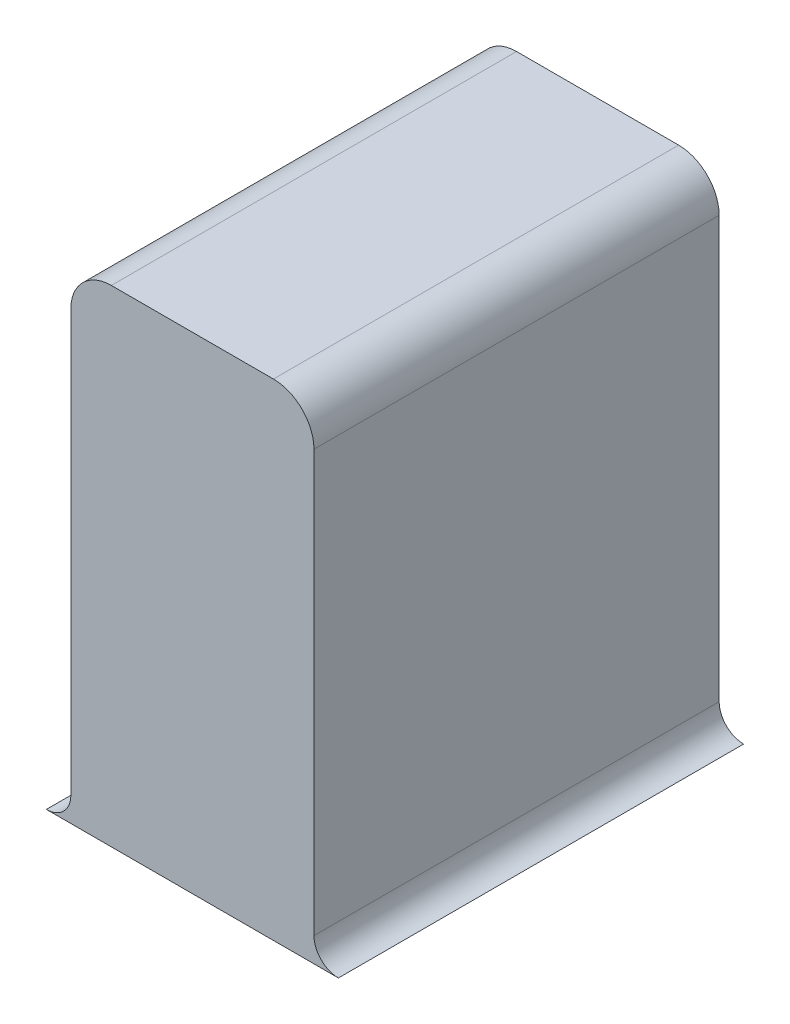
ISO-10303-21;
HEADER;
FILE_DESCRIPTION(('STEP AP214'),'2;1');
FILE_NAME('part.step','',(''),(''),'','','');
FILE_SCHEMA(('AUTOMOTIVE_DESIGN { 1 0 10303 214 1 1 1 1 }'));
ENDSEC;
DATA;
#1=APPLICATION_CONTEXT('core data for automotive mechanical design processes');
#2=APPLICATION_PROTOCOL_DEFINITION('international standard','automotive_design',2000,#1);
#3=PRODUCT_CONTEXT('',#1,'mechanical');
#4=PRODUCT('Part','Part','',(#3));
#5=PRODUCT_RELATED_PRODUCT_CATEGORY('part','',(#4));
#6=PRODUCT_DEFINITION_FORMATION('','',#4);
#7=PRODUCT_DEFINITION_CONTEXT('part definition',#1,'design');
#8=PRODUCT_DEFINITION('design','',#6,#7);
#9=PRODUCT_DEFINITION_SHAPE('','',#8);
#10=(LENGTH_UNIT() NAMED_UNIT(*) SI_UNIT(.MILLI.,.METRE.));
#11=(NAMED_UNIT(*) PLANE_ANGLE_UNIT() SI_UNIT($,.RADIAN.));
#12=(NAMED_UNIT(*) SI_UNIT($,.STERADIAN.) SOLID_ANGLE_UNIT());
#13=UNCERTAINTY_MEASURE_WITH_UNIT(LENGTH_MEASURE(1.E-05),#10,'distance_accuracy_value','');
#14=(GEOMETRIC_REPRESENTATION_CONTEXT(3) GLOBAL_UNCERTAINTY_ASSIGNED_CONTEXT((#13)) GLOBAL_UNIT_ASSIGNED_CONTEXT((#10,
#11,#12)) REPRESENTATION_CONTEXT('',''));
#15=CARTESIAN_POINT('',(0.,0.,0.));
#16=DIRECTION('',(0.,0.,1.));
#17=DIRECTION('',(1.,0.,0.));
#18=AXIS2_PLACEMENT_3D('',#15,#16,#17);
#19=CARTESIAN_POINT('',(-1.,0.,5.));
#20=DIRECTION('',(1.,0.,0.));
#21=DIRECTION('',(0.,1.,0.));
#22=AXIS2_PLACEMENT_3D('',#19,#20,#21);
#23=PLANE('',#22);
#24=DIRECTION('',(0.,-1.,0.));
#25=VECTOR('',#24,1.);
#26=CARTESIAN_POINT('',(-1.,0.,5.));
#27=LINE('',#26,#25);
#28=CARTESIAN_POINT('',(-1.,-32.3703703703704,5.));
#29=VERTEX_POINT('',#28);
#30=CARTESIAN_POINT('',(-1.,-37.5685030472031,5.));
#31=VERTEX_POINT('',#30);
#32=EDGE_CURVE('E109',#29,#31,#27,.T.);
#33=ORIENTED_EDGE('',*,*,#32,.T.);
#34=DIRECTION('',(0.,0.,-1.));
#35=VECTOR('',#34,1.);
#36=CARTESIAN_POINT('',(-1.,-37.5685030472031,5.));
#37=LINE('',#36,#35);
#38=CARTESIAN_POINT('',(-1.,-37.5685030472031,0.));
#39=VERTEX_POINT('',#38);
#40=EDGE_CURVE('E128',#31,#39,#37,.T.);
#41=ORIENTED_EDGE('',*,*,#40,.T.);
#42=DIRECTION('',(0.,-1.,0.));
#43=VECTOR('',#42,1.);
#44=CARTESIAN_POINT('',(-1.,0.,0.));
#45=LINE('',#44,#43);
#46=CARTESIAN_POINT('',(-1.,-32.3703703703704,0.));
#47=VERTEX_POINT('',#46);
#48=EDGE_CURVE('E137',#47,#39,#45,.T.);
#49=ORIENTED_EDGE('',*,*,#48,.F.);
#50=DIRECTION('',(0.,0.,-1.));
#51=VECTOR('',#50,1.);
#52=CARTESIAN_POINT('',(-1.,-32.3703703703704,5.));
#53=LINE('',#52,#51);
#54=EDGE_CURVE('E157',#47,#29,#53,.F.);
#55=ORIENTED_EDGE('',*,*,#54,.T.);
#56=EDGE_LOOP('',(#33,#41,#49,#55));
#57=FACE_BOUND('',#56,.T.);
#58=ADVANCED_FACE('F35',(#57),#23,.T.);
#59=CARTESIAN_POINT('',(0.,-31.8703703703704,5.));
#60=DIRECTION('',(0.,-1.,0.));
#61=DIRECTION('',(0.,0.,-1.));
#62=AXIS2_PLACEMENT_3D('',#59,#60,#61);
#63=PLANE('',#62);
#64=DIRECTION('',(-1.,0.,0.));
#65=VECTOR('',#64,1.);
#66=CARTESIAN_POINT('',(0.,-31.8703703703704,5.));
#67=LINE('',#66,#65);
#68=CARTESIAN_POINT('',(-1.5,-31.8703703703704,5.));
#69=VERTEX_POINT('',#68);
#70=CARTESIAN_POINT('',(-3.5,-31.8703703703704,5.));
#71=VERTEX_POINT('',#70);
#72=EDGE_CURVE('E134',#69,#71,#67,.T.);
#73=ORIENTED_EDGE('',*,*,#72,.F.);
#74=DIRECTION('',(0.,0.,-1.));
#75=VECTOR('',#74,1.);
#76=CARTESIAN_POINT('',(-1.5,-31.8703703703704,0.));
#77=LINE('',#76,#75);
#78=CARTESIAN_POINT('',(-1.5,-31.8703703703704,0.));
#79=VERTEX_POINT('',#78);
#80=EDGE_CURVE('E150',#69,#79,#77,.T.);
#81=ORIENTED_EDGE('',*,*,#80,.T.);
#82=DIRECTION('',(-1.,0.,0.));
#83=VECTOR('',#82,1.);
#84=CARTESIAN_POINT('',(0.,-31.8703703703704,0.));
#85=LINE('',#84,#83);
#86=CARTESIAN_POINT('',(-3.5,-31.8703703703704,0.));
#87=VERTEX_POINT('',#86);
#88=EDGE_CURVE('E133',#79,#87,#85,.T.);
#89=ORIENTED_EDGE('',*,*,#88,.T.);
#90=DIRECTION('',(0.,0.,-1.));
#91=VECTOR('',#90,1.);
#92=CARTESIAN_POINT('',(-3.5,-31.8703703703704,5.));
#93=LINE('',#92,#91);
#94=EDGE_CURVE('E141',#87,#71,#93,.F.);
#95=ORIENTED_EDGE('',*,*,#94,.T.);
#96=EDGE_LOOP('',(#73,#81,#89,#95));
#97=FACE_BOUND('',#96,.T.);
#98=ADVANCED_FACE('F167',(#97),#63,.F.);
#99=CARTESIAN_POINT('',(-4.00000000000001,0.,5.));
#100=DIRECTION('',(1.,0.,0.));
#101=DIRECTION('',(0.,1.,0.));
#102=AXIS2_PLACEMENT_3D('',#99,#100,#101);
#103=PLANE('',#102);
#104=DIRECTION('',(0.,-1.,0.));
#105=VECTOR('',#104,1.);
#106=CARTESIAN_POINT('',(-4.00000000000001,0.,0.));
#107=LINE('',#106,#105);
#108=CARTESIAN_POINT('',(-4.,-32.3703703703704,0.));
#109=VERTEX_POINT('',#108);
#110=CARTESIAN_POINT('',(-4.,-37.5685030472031,0.));
#111=VERTEX_POINT('',#110);
#112=EDGE_CURVE('E54',#109,#111,#107,.T.);
#113=ORIENTED_EDGE('',*,*,#112,.T.);
#114=DIRECTION('',(0.,0.,-1.));
#115=VECTOR('',#114,1.);
#116=CARTESIAN_POINT('',(-4.,-37.5685030472031,5.));
#117=LINE('',#116,#115);
#118=CARTESIAN_POINT('',(-4.,-37.5685030472031,5.));
#119=VERTEX_POINT('',#118);
#120=EDGE_CURVE('E50',#119,#111,#117,.T.);
#121=ORIENTED_EDGE('',*,*,#120,.F.);
#122=DIRECTION('',(0.,-1.,0.));
#123=VECTOR('',#122,1.);
#124=CARTESIAN_POINT('',(-4.00000000000001,0.,5.));
#125=LINE('',#124,#123);
#126=CARTESIAN_POINT('',(-4.,-32.3703703703704,5.));
#127=VERTEX_POINT('',#126);
#128=EDGE_CURVE('E110',#127,#119,#125,.T.);
#129=ORIENTED_EDGE('',*,*,#128,.F.);
#130=DIRECTION('',(0.,0.,-1.));
#131=VECTOR('',#130,1.);
#132=CARTESIAN_POINT('',(-4.,-32.3703703703704,5.));
#133=LINE('',#132,#131);
#134=EDGE_CURVE('E11',#127,#109,#133,.T.);
#135=ORIENTED_EDGE('',*,*,#134,.T.);
#136=EDGE_LOOP('',(#113,#121,#129,#135));
#137=FACE_BOUND('',#136,.T.);
#138=ADVANCED_FACE('F181',(#137),#103,.F.);
#139=CARTESIAN_POINT('',(0.,-37.8703703703704,5.));
#140=DIRECTION('',(0.,-1.,0.));
#141=DIRECTION('',(0.,0.,-1.));
#142=AXIS2_PLACEMENT_3D('',#139,#140,#141);
#143=PLANE('',#142);
#144=DIRECTION('',(-1.,0.,0.));
#145=VECTOR('',#144,1.);
#146=CARTESIAN_POINT('',(0.,-37.8703703703704,0.));
#147=LINE('',#146,#145);
#148=CARTESIAN_POINT('',(-0.698132676832734,-37.8703703703704,0.));
#149=VERTEX_POINT('',#148);
#150=CARTESIAN_POINT('',(-4.30186732316727,-37.8703703703704,0.));
#151=VERTEX_POINT('',#150);
#152=EDGE_CURVE('E145',#149,#151,#147,.T.);
#153=ORIENTED_EDGE('',*,*,#152,.F.);
#154=DIRECTION('',(0.,0.,-1.));
#155=VECTOR('',#154,1.);
#156=CARTESIAN_POINT('',(-0.698132676832734,-37.8703703703704,5.));
#157=LINE('',#156,#155);
#158=CARTESIAN_POINT('',(-0.698132676832734,-37.8703703703704,5.));
#159=VERTEX_POINT('',#158);
#160=EDGE_CURVE('E105',#159,#149,#157,.T.);
#161=ORIENTED_EDGE('',*,*,#160,.F.);
#162=DIRECTION('',(-1.,0.,0.));
#163=VECTOR('',#162,1.);
#164=CARTESIAN_POINT('',(0.,-37.8703703703704,5.));
#165=LINE('',#164,#163);
#166=CARTESIAN_POINT('',(-4.30186732316727,-37.8703703703704,5.));
#167=VERTEX_POINT('',#166);
#168=EDGE_CURVE('E99',#159,#167,#165,.T.);
#169=ORIENTED_EDGE('',*,*,#168,.T.);
#170=DIRECTION('',(0.,0.,-1.));
#171=VECTOR('',#170,1.);
#172=CARTESIAN_POINT('',(-4.30186732316727,-37.8703703703704,5.));
#173=LINE('',#172,#171);
#174=EDGE_CURVE('E102',#167,#151,#173,.T.);
#175=ORIENTED_EDGE('',*,*,#174,.T.);
#176=EDGE_LOOP('',(#153,#161,#169,#175));
#177=FACE_BOUND('',#176,.T.);
#178=ADVANCED_FACE('F101',(#177),#143,.T.);
#179=CARTESIAN_POINT('',(0.,0.,5.));
#180=DIRECTION('',(0.,0.,1.));
#181=DIRECTION('',(1.,0.,0.));
#182=AXIS2_PLACEMENT_3D('',#179,#180,#181);
#183=PLANE('',#182);
#184=ORIENTED_EDGE('',*,*,#32,.F.);
#185=CARTESIAN_POINT('',(-1.5,-32.3703703703704,5.));
#186=DIRECTION('',(0.,0.,1.));
#187=DIRECTION('',(1.,0.,0.));
#188=AXIS2_PLACEMENT_3D('',#185,#186,#187);
#189=CIRCLE('',#188,0.5);
#190=EDGE_CURVE('E43',#29,#69,#189,.T.);
#191=ORIENTED_EDGE('',*,*,#190,.T.);
#192=ORIENTED_EDGE('',*,*,#72,.T.);
#193=CARTESIAN_POINT('',(-3.5,-32.3703703703704,5.));
#194=DIRECTION('',(0.,0.,1.));
#195=DIRECTION('',(1.,0.,0.));
#196=AXIS2_PLACEMENT_3D('',#193,#194,#195);
#197=CIRCLE('',#196,0.5);
#198=EDGE_CURVE('E159',#71,#127,#197,.T.);
#199=ORIENTED_EDGE('',*,*,#198,.T.);
#200=ORIENTED_EDGE('',*,*,#128,.T.);
#201=CARTESIAN_POINT('',(-4.30186732316727,-37.5685030472031,5.));
#202=DIRECTION('',(0.,0.,1.));
#203=DIRECTION('',(1.,0.,0.));
#204=AXIS2_PLACEMENT_3D('',#201,#202,#203);
#205=CIRCLE('',#204,0.301867323167267);
#206=EDGE_CURVE('E115',#167,#119,#205,.T.);
#207=ORIENTED_EDGE('',*,*,#206,.F.);
#208=ORIENTED_EDGE('',*,*,#168,.F.);
#209=CARTESIAN_POINT('',(-0.698132676832734,-37.5685030472031,5.));
#210=DIRECTION('',(0.,0.,1.));
#211=DIRECTION('',(1.,0.,0.));
#212=AXIS2_PLACEMENT_3D('',#209,#210,#211);
#213=CIRCLE('',#212,0.301867323167267);
#214=EDGE_CURVE('E126',#159,#31,#213,.F.);
#215=ORIENTED_EDGE('',*,*,#214,.T.);
#216=EDGE_LOOP('',(#184,#191,#192,#199,#200,#207,#208,#215));
#217=FACE_BOUND('',#216,.T.);
#218=ADVANCED_FACE('F121',(#217),#183,.T.);
#219=CARTESIAN_POINT('',(0.,0.,0.));
#220=DIRECTION('',(0.,0.,1.));
#221=DIRECTION('',(1.,0.,0.));
#222=AXIS2_PLACEMENT_3D('',#219,#220,#221);
#223=PLANE('',#222);
#224=ORIENTED_EDGE('',*,*,#88,.F.);
#225=CARTESIAN_POINT('',(-1.5,-32.3703703703704,0.));
#226=DIRECTION('',(0.,0.,1.));
#227=DIRECTION('',(1.,0.,0.));
#228=AXIS2_PLACEMENT_3D('',#225,#226,#227);
#229=CIRCLE('',#228,0.5);
#230=EDGE_CURVE('E155',#79,#47,#229,.F.);
#231=ORIENTED_EDGE('',*,*,#230,.T.);
#232=ORIENTED_EDGE('',*,*,#48,.T.);
#233=CARTESIAN_POINT('',(-0.698132676832734,-37.5685030472031,0.));
#234=DIRECTION('',(0.,0.,1.));
#235=DIRECTION('',(1.,0.,0.));
#236=AXIS2_PLACEMENT_3D('',#233,#234,#235);
#237=CIRCLE('',#236,0.301867323167267);
#238=EDGE_CURVE('E118',#149,#39,#237,.F.);
#239=ORIENTED_EDGE('',*,*,#238,.F.);
#240=ORIENTED_EDGE('',*,*,#152,.T.);
#241=CARTESIAN_POINT('',(-4.30186732316727,-37.5685030472031,0.));
#242=DIRECTION('',(0.,0.,1.));
#243=DIRECTION('',(1.,0.,0.));
#244=AXIS2_PLACEMENT_3D('',#241,#242,#243);
#245=CIRCLE('',#244,0.301867323167267);
#246=EDGE_CURVE('E117',#151,#111,#245,.T.);
#247=ORIENTED_EDGE('',*,*,#246,.T.);
#248=ORIENTED_EDGE('',*,*,#112,.F.);
#249=CARTESIAN_POINT('',(-3.5,-32.3703703703704,0.));
#250=DIRECTION('',(0.,0.,1.));
#251=DIRECTION('',(1.,0.,0.));
#252=AXIS2_PLACEMENT_3D('',#249,#250,#251);
#253=CIRCLE('',#252,0.5);
#254=EDGE_CURVE('E153',#109,#87,#253,.F.);
#255=ORIENTED_EDGE('',*,*,#254,.T.);
#256=EDGE_LOOP('',(#224,#231,#232,#239,#240,#247,#248,#255));
#257=FACE_BOUND('',#256,.T.);
#258=ADVANCED_FACE('F173',(#257),#223,.F.);
#259=CARTESIAN_POINT('',(-1.5,-32.3703703703704,5.));
#260=DIRECTION('',(0.,0.,1.));
#261=DIRECTION('',(1.,0.,0.));
#262=AXIS2_PLACEMENT_3D('',#259,#260,#261);
#263=CYLINDRICAL_SURFACE('',#262,0.5);
#264=ORIENTED_EDGE('',*,*,#190,.F.);
#265=ORIENTED_EDGE('',*,*,#54,.F.);
#266=ORIENTED_EDGE('',*,*,#230,.F.);
#267=ORIENTED_EDGE('',*,*,#80,.F.);
#268=EDGE_LOOP('',(#264,#265,#266,#267));
#269=FACE_BOUND('',#268,.T.);
#270=ADVANCED_FACE('F170',(#269),#263,.T.);
#271=CARTESIAN_POINT('',(-3.5,-32.3703703703704,5.));
#272=DIRECTION('',(0.,0.,-1.));
#273=DIRECTION('',(-1.,0.,0.));
#274=AXIS2_PLACEMENT_3D('',#271,#272,#273);
#275=CYLINDRICAL_SURFACE('',#274,0.5);
#276=ORIENTED_EDGE('',*,*,#198,.F.);
#277=ORIENTED_EDGE('',*,*,#94,.F.);
#278=ORIENTED_EDGE('',*,*,#254,.F.);
#279=ORIENTED_EDGE('',*,*,#134,.F.);
#280=EDGE_LOOP('',(#276,#277,#278,#279));
#281=FACE_BOUND('',#280,.T.);
#282=ADVANCED_FACE('F37',(#281),#275,.T.);
#283=CARTESIAN_POINT('',(-0.698132676832734,-37.5685030472031,5.));
#284=DIRECTION('',(0.,0.,-1.));
#285=DIRECTION('',(-1.,0.,0.));
#286=AXIS2_PLACEMENT_3D('',#283,#284,#285);
#287=CYLINDRICAL_SURFACE('',#286,0.301867323167267);
#288=ORIENTED_EDGE('',*,*,#238,.T.);
#289=ORIENTED_EDGE('',*,*,#40,.F.);
#290=ORIENTED_EDGE('',*,*,#214,.F.);
#291=ORIENTED_EDGE('',*,*,#160,.T.);
#292=EDGE_LOOP('',(#288,#289,#290,#291));
#293=FACE_BOUND('',#292,.T.);
#294=ADVANCED_FACE('F178',(#293),#287,.F.);
#295=CARTESIAN_POINT('',(-4.30186732316727,-37.5685030472031,5.));
#296=DIRECTION('',(0.,0.,-1.));
#297=DIRECTION('',(-1.,0.,0.));
#298=AXIS2_PLACEMENT_3D('',#295,#296,#297);
#299=CYLINDRICAL_SURFACE('',#298,0.301867323167267);
#300=ORIENTED_EDGE('',*,*,#246,.F.);
#301=ORIENTED_EDGE('',*,*,#174,.F.);
#302=ORIENTED_EDGE('',*,*,#206,.T.);
#303=ORIENTED_EDGE('',*,*,#120,.T.);
#304=EDGE_LOOP('',(#300,#301,#302,#303));
#305=FACE_BOUND('',#304,.T.);
#306=ADVANCED_FACE('F114',(#305),#299,.F.);
#307=CLOSED_SHELL('',(#58,#98,#138,#178,#218,#258,#270,#282,#294,#306));
#308=MANIFOLD_SOLID_BREP('B2',#307);
#309=ADVANCED_BREP_SHAPE_REPRESENTATION('',(#18,#308),#14);
#310=SHAPE_DEFINITION_REPRESENTATION(#9,#309);
ENDSEC;
END-ISO-10303-21;
